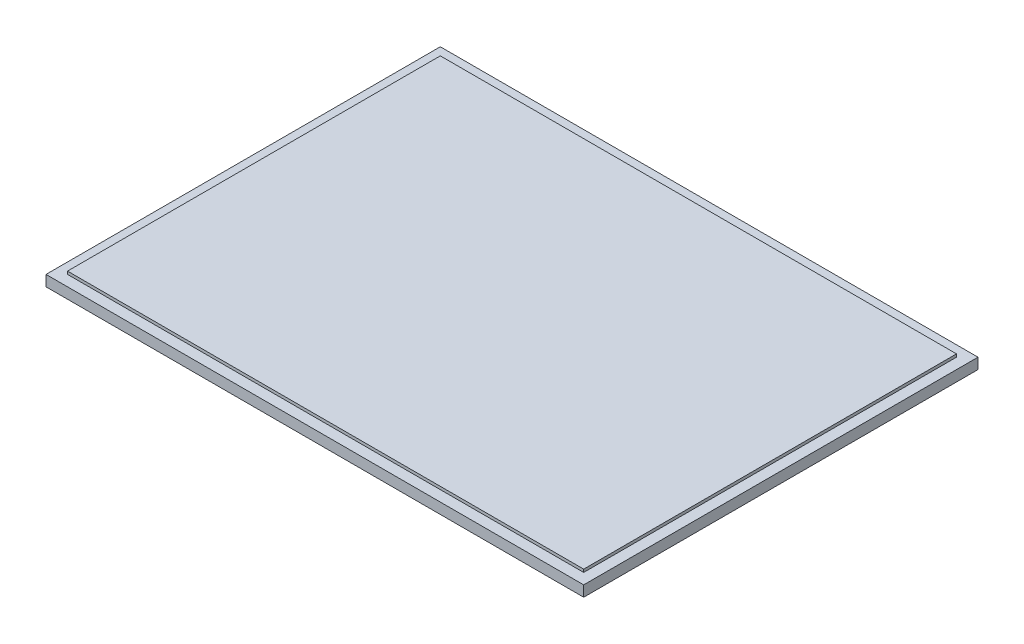
ISO-10303-21;
HEADER;
FILE_DESCRIPTION(('STEP AP214'),'2;1');
FILE_NAME('part.step','',(''),(''),'','','');
FILE_SCHEMA(('AUTOMOTIVE_DESIGN { 1 0 10303 214 1 1 1 1 }'));
ENDSEC;
DATA;
#1=APPLICATION_CONTEXT('core data for automotive mechanical design processes');
#2=APPLICATION_PROTOCOL_DEFINITION('international standard','automotive_design',2000,#1);
#3=PRODUCT_CONTEXT('',#1,'mechanical');
#4=PRODUCT('Part','Part','',(#3));
#5=PRODUCT_RELATED_PRODUCT_CATEGORY('part','',(#4));
#6=PRODUCT_DEFINITION_FORMATION('','',#4);
#7=PRODUCT_DEFINITION_CONTEXT('part definition',#1,'design');
#8=PRODUCT_DEFINITION('design','',#6,#7);
#9=PRODUCT_DEFINITION_SHAPE('','',#8);
#10=(LENGTH_UNIT() NAMED_UNIT(*) SI_UNIT(.MILLI.,.METRE.));
#11=(NAMED_UNIT(*) PLANE_ANGLE_UNIT() SI_UNIT($,.RADIAN.));
#12=(NAMED_UNIT(*) SI_UNIT($,.STERADIAN.) SOLID_ANGLE_UNIT());
#13=UNCERTAINTY_MEASURE_WITH_UNIT(LENGTH_MEASURE(1.E-05),#10,'distance_accuracy_value','');
#14=(GEOMETRIC_REPRESENTATION_CONTEXT(3) GLOBAL_UNCERTAINTY_ASSIGNED_CONTEXT((#13)) GLOBAL_UNIT_ASSIGNED_CONTEXT((#10,
#11,#12)) REPRESENTATION_CONTEXT('',''));
#15=CARTESIAN_POINT('',(0.,0.,0.));
#16=DIRECTION('',(0.,0.,1.));
#17=DIRECTION('',(1.,0.,0.));
#18=AXIS2_PLACEMENT_3D('',#15,#16,#17);
#19=CARTESIAN_POINT('',(-375.,19.,275.));
#20=DIRECTION('',(1.,0.,0.));
#21=DIRECTION('',(0.,0.,-1.));
#22=AXIS2_PLACEMENT_3D('',#19,#20,#21);
#23=PLANE('',#22);
#24=DIRECTION('',(0.,0.,1.));
#25=VECTOR('',#24,1.);
#26=CARTESIAN_POINT('',(-375.,15.,-275.));
#27=LINE('',#26,#25);
#28=CARTESIAN_POINT('',(-375.,15.,-275.));
#29=VERTEX_POINT('',#28);
#30=CARTESIAN_POINT('',(-375.,15.,275.));
#31=VERTEX_POINT('',#30);
#32=EDGE_CURVE('E142',#29,#31,#27,.T.);
#33=ORIENTED_EDGE('',*,*,#32,.F.);
#34=DIRECTION('',(0.,-1.,0.));
#35=VECTOR('',#34,1.);
#36=CARTESIAN_POINT('',(-375.,19.,-275.));
#37=LINE('',#36,#35);
#38=CARTESIAN_POINT('',(-375.,0.,-275.));
#39=VERTEX_POINT('',#38);
#40=EDGE_CURVE('E159',#29,#39,#37,.T.);
#41=ORIENTED_EDGE('',*,*,#40,.T.);
#42=DIRECTION('',(0.,0.,1.));
#43=VECTOR('',#42,1.);
#44=CARTESIAN_POINT('',(-375.,0.,275.));
#45=LINE('',#44,#43);
#46=CARTESIAN_POINT('',(-375.,0.,275.));
#47=VERTEX_POINT('',#46);
#48=EDGE_CURVE('E147',#39,#47,#45,.T.);
#49=ORIENTED_EDGE('',*,*,#48,.T.);
#50=DIRECTION('',(0.,-1.,0.));
#51=VECTOR('',#50,1.);
#52=CARTESIAN_POINT('',(-375.,19.,275.));
#53=LINE('',#52,#51);
#54=EDGE_CURVE('E11',#31,#47,#53,.T.);
#55=ORIENTED_EDGE('',*,*,#54,.F.);
#56=EDGE_LOOP('',(#33,#41,#49,#55));
#57=FACE_BOUND('',#56,.T.);
#58=ADVANCED_FACE('F37',(#57),#23,.F.);
#59=CARTESIAN_POINT('',(-375.,19.,275.));
#60=DIRECTION('',(0.,0.,-1.));
#61=DIRECTION('',(-1.,0.,0.));
#62=AXIS2_PLACEMENT_3D('',#59,#60,#61);
#63=PLANE('',#62);
#64=DIRECTION('',(1.,0.,0.));
#65=VECTOR('',#64,1.);
#66=CARTESIAN_POINT('',(-375.,15.,275.));
#67=LINE('',#66,#65);
#68=CARTESIAN_POINT('',(375.,15.,275.));
#69=VERTEX_POINT('',#68);
#70=EDGE_CURVE('E144',#31,#69,#67,.T.);
#71=ORIENTED_EDGE('',*,*,#70,.F.);
#72=ORIENTED_EDGE('',*,*,#54,.T.);
#73=DIRECTION('',(1.,0.,0.));
#74=VECTOR('',#73,1.);
#75=CARTESIAN_POINT('',(-375.,0.,275.));
#76=LINE('',#75,#74);
#77=CARTESIAN_POINT('',(375.,0.,275.));
#78=VERTEX_POINT('',#77);
#79=EDGE_CURVE('E150',#47,#78,#76,.T.);
#80=ORIENTED_EDGE('',*,*,#79,.T.);
#81=DIRECTION('',(0.,-1.,0.));
#82=VECTOR('',#81,1.);
#83=CARTESIAN_POINT('',(375.,19.,275.));
#84=LINE('',#83,#82);
#85=EDGE_CURVE('E44',#69,#78,#84,.T.);
#86=ORIENTED_EDGE('',*,*,#85,.F.);
#87=EDGE_LOOP('',(#71,#72,#80,#86));
#88=FACE_BOUND('',#87,.T.);
#89=ADVANCED_FACE('F171',(#88),#63,.F.);
#90=CARTESIAN_POINT('',(375.,19.,275.));
#91=DIRECTION('',(-1.,0.,0.));
#92=DIRECTION('',(0.,0.,1.));
#93=AXIS2_PLACEMENT_3D('',#90,#91,#92);
#94=PLANE('',#93);
#95=DIRECTION('',(0.,0.,-1.));
#96=VECTOR('',#95,1.);
#97=CARTESIAN_POINT('',(375.,15.,275.));
#98=LINE('',#97,#96);
#99=CARTESIAN_POINT('',(375.,15.,-275.));
#100=VERTEX_POINT('',#99);
#101=EDGE_CURVE('E51',#69,#100,#98,.T.);
#102=ORIENTED_EDGE('',*,*,#101,.F.);
#103=ORIENTED_EDGE('',*,*,#85,.T.);
#104=DIRECTION('',(0.,0.,-1.));
#105=VECTOR('',#104,1.);
#106=CARTESIAN_POINT('',(375.,0.,275.));
#107=LINE('',#106,#105);
#108=CARTESIAN_POINT('',(375.,0.,-275.));
#109=VERTEX_POINT('',#108);
#110=EDGE_CURVE('E153',#78,#109,#107,.T.);
#111=ORIENTED_EDGE('',*,*,#110,.T.);
#112=DIRECTION('',(0.,-1.,0.));
#113=VECTOR('',#112,1.);
#114=CARTESIAN_POINT('',(375.,19.,-275.));
#115=LINE('',#114,#113);
#116=EDGE_CURVE('E161',#100,#109,#115,.T.);
#117=ORIENTED_EDGE('',*,*,#116,.F.);
#118=EDGE_LOOP('',(#102,#103,#111,#117));
#119=FACE_BOUND('',#118,.T.);
#120=ADVANCED_FACE('F164',(#119),#94,.F.);
#121=CARTESIAN_POINT('',(-375.,19.,-275.));
#122=DIRECTION('',(0.,0.,1.));
#123=DIRECTION('',(1.,0.,0.));
#124=AXIS2_PLACEMENT_3D('',#121,#122,#123);
#125=PLANE('',#124);
#126=DIRECTION('',(-1.,0.,0.));
#127=VECTOR('',#126,1.);
#128=CARTESIAN_POINT('',(375.,15.,-275.));
#129=LINE('',#128,#127);
#130=EDGE_CURVE('E137',#100,#29,#129,.T.);
#131=ORIENTED_EDGE('',*,*,#130,.F.);
#132=ORIENTED_EDGE('',*,*,#116,.T.);
#133=DIRECTION('',(-1.,0.,0.));
#134=VECTOR('',#133,1.);
#135=CARTESIAN_POINT('',(-375.,0.,-275.));
#136=LINE('',#135,#134);
#137=EDGE_CURVE('E156',#109,#39,#136,.T.);
#138=ORIENTED_EDGE('',*,*,#137,.T.);
#139=ORIENTED_EDGE('',*,*,#40,.F.);
#140=EDGE_LOOP('',(#131,#132,#138,#139));
#141=FACE_BOUND('',#140,.T.);
#142=ADVANCED_FACE('F178',(#141),#125,.F.);
#143=CARTESIAN_POINT('',(0.,0.,0.));
#144=DIRECTION('',(0.,-1.,0.));
#145=DIRECTION('',(0.,0.,-1.));
#146=AXIS2_PLACEMENT_3D('',#143,#144,#145);
#147=PLANE('',#146);
#148=ORIENTED_EDGE('',*,*,#48,.F.);
#149=ORIENTED_EDGE('',*,*,#137,.F.);
#150=ORIENTED_EDGE('',*,*,#110,.F.);
#151=ORIENTED_EDGE('',*,*,#79,.F.);
#152=EDGE_LOOP('',(#148,#149,#150,#151));
#153=FACE_BOUND('',#152,.T.);
#154=ADVANCED_FACE('F175',(#153),#147,.T.);
#155=CARTESIAN_POINT('',(0.,15.,0.));
#156=DIRECTION('',(0.,1.,0.));
#157=DIRECTION('',(0.,0.,1.));
#158=AXIS2_PLACEMENT_3D('',#155,#156,#157);
#159=PLANE('',#158);
#160=DIRECTION('',(0.,0.,-1.));
#161=VECTOR('',#160,1.);
#162=CARTESIAN_POINT('',(360.,15.,260.));
#163=LINE('',#162,#161);
#164=CARTESIAN_POINT('',(360.,15.,260.));
#165=VERTEX_POINT('',#164);
#166=CARTESIAN_POINT('',(360.,15.,-260.));
#167=VERTEX_POINT('',#166);
#168=EDGE_CURVE('E112',#165,#167,#163,.T.);
#169=ORIENTED_EDGE('',*,*,#168,.F.);
#170=DIRECTION('',(1.,0.,0.));
#171=VECTOR('',#170,1.);
#172=CARTESIAN_POINT('',(-360.,15.,260.));
#173=LINE('',#172,#171);
#174=CARTESIAN_POINT('',(-360.,15.,260.));
#175=VERTEX_POINT('',#174);
#176=EDGE_CURVE('E121',#175,#165,#173,.T.);
#177=ORIENTED_EDGE('',*,*,#176,.F.);
#178=DIRECTION('',(0.,0.,1.));
#179=VECTOR('',#178,1.);
#180=CARTESIAN_POINT('',(-360.,15.,-260.));
#181=LINE('',#180,#179);
#182=CARTESIAN_POINT('',(-360.,15.,-260.));
#183=VERTEX_POINT('',#182);
#184=EDGE_CURVE('E104',#183,#175,#181,.T.);
#185=ORIENTED_EDGE('',*,*,#184,.F.);
#186=DIRECTION('',(-1.,0.,0.));
#187=VECTOR('',#186,1.);
#188=CARTESIAN_POINT('',(360.,15.,-260.));
#189=LINE('',#188,#187);
#190=EDGE_CURVE('E118',#167,#183,#189,.T.);
#191=ORIENTED_EDGE('',*,*,#190,.F.);
#192=EDGE_LOOP('',(#169,#177,#185,#191));
#193=FACE_BOUND('',#192,.T.);
#194=ORIENTED_EDGE('',*,*,#130,.T.);
#195=ORIENTED_EDGE('',*,*,#32,.T.);
#196=ORIENTED_EDGE('',*,*,#70,.T.);
#197=ORIENTED_EDGE('',*,*,#101,.T.);
#198=EDGE_LOOP('',(#194,#195,#196,#197));
#199=FACE_BOUND('',#198,.T.);
#200=ADVANCED_FACE('F117',(#193,#199),#159,.T.);
#201=CARTESIAN_POINT('',(360.,15.,-260.));
#202=DIRECTION('',(0.,0.,-1.));
#203=DIRECTION('',(-1.,0.,0.));
#204=AXIS2_PLACEMENT_3D('',#201,#202,#203);
#205=PLANE('',#204);
#206=DIRECTION('',(-1.,0.,0.));
#207=VECTOR('',#206,1.);
#208=CARTESIAN_POINT('',(360.,19.,-260.));
#209=LINE('',#208,#207);
#210=CARTESIAN_POINT('',(360.,19.,-260.));
#211=VERTEX_POINT('',#210);
#212=CARTESIAN_POINT('',(-360.,19.,-260.));
#213=VERTEX_POINT('',#212);
#214=EDGE_CURVE('E132',#211,#213,#209,.T.);
#215=ORIENTED_EDGE('',*,*,#214,.F.);
#216=DIRECTION('',(0.,1.,0.));
#217=VECTOR('',#216,1.);
#218=CARTESIAN_POINT('',(360.,15.,-260.));
#219=LINE('',#218,#217);
#220=EDGE_CURVE('E124',#167,#211,#219,.T.);
#221=ORIENTED_EDGE('',*,*,#220,.F.);
#222=ORIENTED_EDGE('',*,*,#190,.T.);
#223=DIRECTION('',(0.,1.,0.));
#224=VECTOR('',#223,1.);
#225=CARTESIAN_POINT('',(-360.,15.,-260.));
#226=LINE('',#225,#224);
#227=EDGE_CURVE('E101',#183,#213,#226,.T.);
#228=ORIENTED_EDGE('',*,*,#227,.T.);
#229=EDGE_LOOP('',(#215,#221,#222,#228));
#230=FACE_BOUND('',#229,.T.);
#231=ADVANCED_FACE('F123',(#230),#205,.T.);
#232=CARTESIAN_POINT('',(360.,15.,260.));
#233=DIRECTION('',(1.,0.,0.));
#234=DIRECTION('',(0.,0.,-1.));
#235=AXIS2_PLACEMENT_3D('',#232,#233,#234);
#236=PLANE('',#235);
#237=DIRECTION('',(0.,0.,-1.));
#238=VECTOR('',#237,1.);
#239=CARTESIAN_POINT('',(360.,19.,260.));
#240=LINE('',#239,#238);
#241=CARTESIAN_POINT('',(360.,19.,260.));
#242=VERTEX_POINT('',#241);
#243=EDGE_CURVE('E125',#242,#211,#240,.T.);
#244=ORIENTED_EDGE('',*,*,#243,.F.);
#245=DIRECTION('',(0.,1.,0.));
#246=VECTOR('',#245,1.);
#247=CARTESIAN_POINT('',(360.,15.,260.));
#248=LINE('',#247,#246);
#249=EDGE_CURVE('E138',#165,#242,#248,.T.);
#250=ORIENTED_EDGE('',*,*,#249,.F.);
#251=ORIENTED_EDGE('',*,*,#168,.T.);
#252=ORIENTED_EDGE('',*,*,#220,.T.);
#253=EDGE_LOOP('',(#244,#250,#251,#252));
#254=FACE_BOUND('',#253,.T.);
#255=ADVANCED_FACE('F202',(#254),#236,.T.);
#256=CARTESIAN_POINT('',(-360.,15.,260.));
#257=DIRECTION('',(0.,0.,1.));
#258=DIRECTION('',(1.,0.,0.));
#259=AXIS2_PLACEMENT_3D('',#256,#257,#258);
#260=PLANE('',#259);
#261=DIRECTION('',(1.,0.,0.));
#262=VECTOR('',#261,1.);
#263=CARTESIAN_POINT('',(-360.,19.,260.));
#264=LINE('',#263,#262);
#265=CARTESIAN_POINT('',(-360.,19.,260.));
#266=VERTEX_POINT('',#265);
#267=EDGE_CURVE('E59',#266,#242,#264,.T.);
#268=ORIENTED_EDGE('',*,*,#267,.F.);
#269=DIRECTION('',(0.,1.,0.));
#270=VECTOR('',#269,1.);
#271=CARTESIAN_POINT('',(-360.,15.,260.));
#272=LINE('',#271,#270);
#273=EDGE_CURVE('E111',#175,#266,#272,.T.);
#274=ORIENTED_EDGE('',*,*,#273,.F.);
#275=ORIENTED_EDGE('',*,*,#176,.T.);
#276=ORIENTED_EDGE('',*,*,#249,.T.);
#277=EDGE_LOOP('',(#268,#274,#275,#276));
#278=FACE_BOUND('',#277,.T.);
#279=ADVANCED_FACE('F205',(#278),#260,.T.);
#280=CARTESIAN_POINT('',(-360.,15.,-260.));
#281=DIRECTION('',(-1.,0.,0.));
#282=DIRECTION('',(0.,0.,1.));
#283=AXIS2_PLACEMENT_3D('',#280,#281,#282);
#284=PLANE('',#283);
#285=DIRECTION('',(0.,0.,1.));
#286=VECTOR('',#285,1.);
#287=CARTESIAN_POINT('',(-360.,19.,-260.));
#288=LINE('',#287,#286);
#289=EDGE_CURVE('E106',#213,#266,#288,.T.);
#290=ORIENTED_EDGE('',*,*,#289,.F.);
#291=ORIENTED_EDGE('',*,*,#227,.F.);
#292=ORIENTED_EDGE('',*,*,#184,.T.);
#293=ORIENTED_EDGE('',*,*,#273,.T.);
#294=EDGE_LOOP('',(#290,#291,#292,#293));
#295=FACE_BOUND('',#294,.T.);
#296=ADVANCED_FACE('F103',(#295),#284,.T.);
#297=CARTESIAN_POINT('',(0.,19.,0.));
#298=DIRECTION('',(0.,-1.,0.));
#299=DIRECTION('',(0.,0.,-1.));
#300=AXIS2_PLACEMENT_3D('',#297,#298,#299);
#301=PLANE('',#300);
#302=ORIENTED_EDGE('',*,*,#214,.T.);
#303=ORIENTED_EDGE('',*,*,#289,.T.);
#304=ORIENTED_EDGE('',*,*,#267,.T.);
#305=ORIENTED_EDGE('',*,*,#243,.T.);
#306=EDGE_LOOP('',(#302,#303,#304,#305));
#307=FACE_BOUND('',#306,.T.);
#308=ADVANCED_FACE('F194',(#307),#301,.F.);
#309=CLOSED_SHELL('',(#58,#89,#120,#142,#154,#200,#231,#255,#279,#296,#308));
#310=MANIFOLD_SOLID_BREP('B2',#309);
#311=ADVANCED_BREP_SHAPE_REPRESENTATION('',(#18,#310),#14);
#312=SHAPE_DEFINITION_REPRESENTATION(#9,#311);
ENDSEC;
END-ISO-10303-21;
